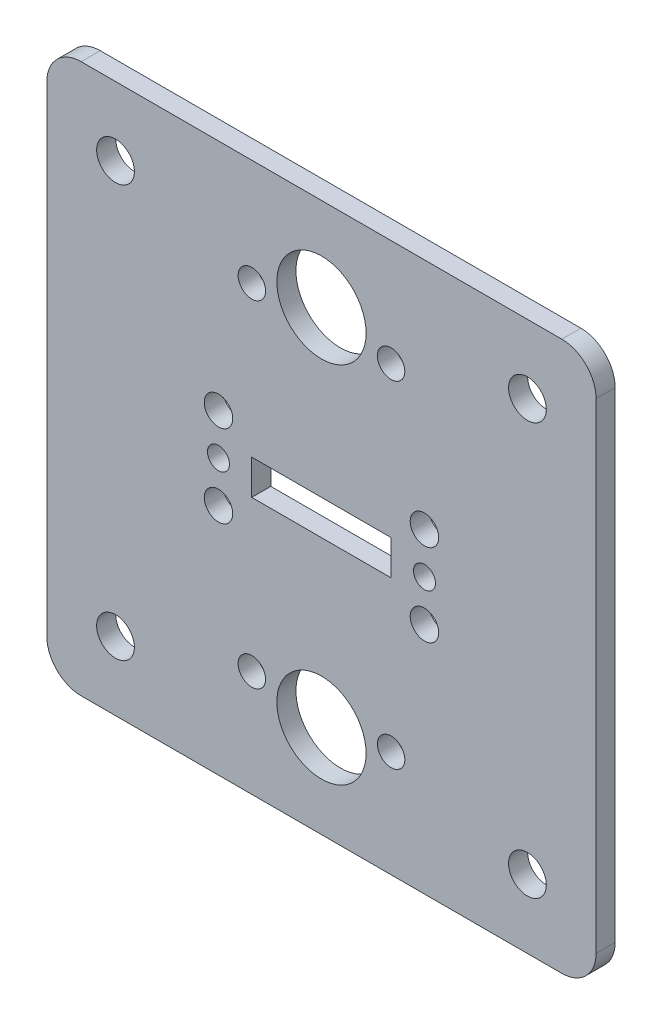
ISO-10303-21;
HEADER;
FILE_DESCRIPTION(('STEP AP214'),'2;1');
FILE_NAME('part.step','',(''),(''),'','','');
FILE_SCHEMA(('AUTOMOTIVE_DESIGN { 1 0 10303 214 1 1 1 1 }'));
ENDSEC;
DATA;
#1=APPLICATION_CONTEXT('core data for automotive mechanical design processes');
#2=APPLICATION_PROTOCOL_DEFINITION('international standard','automotive_design',2000,#1);
#3=PRODUCT_CONTEXT('',#1,'mechanical');
#4=PRODUCT('Part','Part','',(#3));
#5=PRODUCT_RELATED_PRODUCT_CATEGORY('part','',(#4));
#6=PRODUCT_DEFINITION_FORMATION('','',#4);
#7=PRODUCT_DEFINITION_CONTEXT('part definition',#1,'design');
#8=PRODUCT_DEFINITION('design','',#6,#7);
#9=PRODUCT_DEFINITION_SHAPE('','',#8);
#10=(LENGTH_UNIT() NAMED_UNIT(*) SI_UNIT(.MILLI.,.METRE.));
#11=(NAMED_UNIT(*) PLANE_ANGLE_UNIT() SI_UNIT($,.RADIAN.));
#12=(NAMED_UNIT(*) SI_UNIT($,.STERADIAN.) SOLID_ANGLE_UNIT());
#13=UNCERTAINTY_MEASURE_WITH_UNIT(LENGTH_MEASURE(1.E-05),#10,'distance_accuracy_value','');
#14=(GEOMETRIC_REPRESENTATION_CONTEXT(3) GLOBAL_UNCERTAINTY_ASSIGNED_CONTEXT((#13)) GLOBAL_UNIT_ASSIGNED_CONTEXT((#10,
#11,#12)) REPRESENTATION_CONTEXT('',''));
#15=CARTESIAN_POINT('',(0.,0.,0.));
#16=DIRECTION('',(0.,0.,1.));
#17=DIRECTION('',(1.,0.,0.));
#18=AXIS2_PLACEMENT_3D('',#15,#16,#17);
#19=CARTESIAN_POINT('',(-35.,-35.,2.778125));
#20=DIRECTION('',(0.,0.,1.));
#21=DIRECTION('',(1.,0.,0.));
#22=AXIS2_PLACEMENT_3D('',#19,#20,#21);
#23=PLANE('',#22);
#24=CARTESIAN_POINT('',(15.,-6.,2.778125));
#25=DIRECTION('',(0.,0.,1.));
#26=DIRECTION('',(1.,0.,0.));
#27=AXIS2_PLACEMENT_3D('',#24,#25,#26);
#28=CIRCLE('',#27,2.075);
#29=CARTESIAN_POINT('',(17.075,-6.,2.778125));
#30=VERTEX_POINT('',#29);
#31=EDGE_CURVE('E368',#30,#30,#28,.T.);
#32=ORIENTED_EDGE('',*,*,#31,.F.);
#33=EDGE_LOOP('',(#32));
#34=FACE_BOUND('',#33,.T.);
#35=CARTESIAN_POINT('',(-15.,6.,2.778125));
#36=DIRECTION('',(0.,0.,1.));
#37=DIRECTION('',(1.,0.,0.));
#38=AXIS2_PLACEMENT_3D('',#35,#36,#37);
#39=CIRCLE('',#38,2.075);
#40=CARTESIAN_POINT('',(-12.925,6.,2.778125));
#41=VERTEX_POINT('',#40);
#42=EDGE_CURVE('E380',#41,#41,#39,.T.);
#43=ORIENTED_EDGE('',*,*,#42,.F.);
#44=EDGE_LOOP('',(#43));
#45=FACE_BOUND('',#44,.T.);
#46=CARTESIAN_POINT('',(-14.9999999999864,3.40474063403179E-12,2.778125));
#47=DIRECTION('',(0.,0.,1.));
#48=DIRECTION('',(1.,0.,0.));
#49=AXIS2_PLACEMENT_3D('',#46,#47,#48);
#50=CIRCLE('',#49,1.59999999999901);
#51=CARTESIAN_POINT('',(-13.3999999999873,3.40474063403179E-12,2.778125));
#52=VERTEX_POINT('',#51);
#53=EDGE_CURVE('E392',#52,#52,#50,.T.);
#54=ORIENTED_EDGE('',*,*,#53,.F.);
#55=EDGE_LOOP('',(#54));
#56=FACE_BOUND('',#55,.T.);
#57=CARTESIAN_POINT('',(-10.1411109576702,-24.482807611551,2.778125));
#58=DIRECTION('',(0.,0.,1.));
#59=DIRECTION('',(1.,0.,0.));
#60=AXIS2_PLACEMENT_3D('',#57,#58,#59);
#61=CIRCLE('',#60,2.);
#62=CARTESIAN_POINT('',(-8.14111095767023,-24.482807611551,2.778125));
#63=VERTEX_POINT('',#62);
#64=EDGE_CURVE('E404',#63,#63,#61,.T.);
#65=ORIENTED_EDGE('',*,*,#64,.F.);
#66=EDGE_LOOP('',(#65));
#67=FACE_BOUND('',#66,.T.);
#68=CARTESIAN_POINT('',(-10.1411109576752,24.4828076115472,2.778125));
#69=DIRECTION('',(0.,0.,1.));
#70=DIRECTION('',(1.,0.,0.));
#71=AXIS2_PLACEMENT_3D('',#68,#69,#70);
#72=CIRCLE('',#71,2.);
#73=CARTESIAN_POINT('',(-8.14111095767523,24.4828076115472,2.778125));
#74=VERTEX_POINT('',#73);
#75=EDGE_CURVE('E416',#74,#74,#72,.T.);
#76=ORIENTED_EDGE('',*,*,#75,.F.);
#77=EDGE_LOOP('',(#76));
#78=FACE_BOUND('',#77,.T.);
#79=CARTESIAN_POINT('',(2.43730012379827E-12,-26.5,2.778125));
#80=DIRECTION('',(0.,0.,1.));
#81=DIRECTION('',(1.,0.,0.));
#82=AXIS2_PLACEMENT_3D('',#79,#80,#81);
#83=CIRCLE('',#82,6.5);
#84=CARTESIAN_POINT('',(6.50000000000244,-26.5,2.778125));
#85=VERTEX_POINT('',#84);
#86=EDGE_CURVE('E428',#85,#85,#83,.T.);
#87=ORIENTED_EDGE('',*,*,#86,.F.);
#88=EDGE_LOOP('',(#87));
#89=FACE_BOUND('',#88,.T.);
#90=CARTESIAN_POINT('',(30.,-30.,2.778125));
#91=DIRECTION('',(0.,0.,1.));
#92=DIRECTION('',(1.,0.,0.));
#93=AXIS2_PLACEMENT_3D('',#90,#91,#92);
#94=CIRCLE('',#93,2.74999999999999);
#95=CARTESIAN_POINT('',(32.75,-30.,2.778125));
#96=VERTEX_POINT('',#95);
#97=EDGE_CURVE('E440',#96,#96,#94,.T.);
#98=ORIENTED_EDGE('',*,*,#97,.F.);
#99=EDGE_LOOP('',(#98));
#100=FACE_BOUND('',#99,.T.);
#101=CARTESIAN_POINT('',(-30.,30.,2.778125));
#102=DIRECTION('',(0.,0.,1.));
#103=DIRECTION('',(1.,0.,0.));
#104=AXIS2_PLACEMENT_3D('',#101,#102,#103);
#105=CIRCLE('',#104,2.75);
#106=CARTESIAN_POINT('',(-27.25,30.,2.778125));
#107=VERTEX_POINT('',#106);
#108=EDGE_CURVE('E151',#107,#107,#105,.T.);
#109=ORIENTED_EDGE('',*,*,#108,.F.);
#110=EDGE_LOOP('',(#109));
#111=FACE_BOUND('',#110,.T.);
#112=CARTESIAN_POINT('',(-35.,-35.,2.778125));
#113=DIRECTION('',(0.,0.,1.));
#114=DIRECTION('',(1.,0.,0.));
#115=AXIS2_PLACEMENT_3D('',#112,#113,#114);
#116=CIRCLE('',#115,4.99999999999999);
#117=CARTESIAN_POINT('',(-40.,-35.,2.778125));
#118=VERTEX_POINT('',#117);
#119=CARTESIAN_POINT('',(-35.,-40.,2.778125));
#120=VERTEX_POINT('',#119);
#121=EDGE_CURVE('E161',#118,#120,#116,.T.);
#122=ORIENTED_EDGE('',*,*,#121,.T.);
#123=DIRECTION('',(1.,0.,0.));
#124=VECTOR('',#123,1.);
#125=CARTESIAN_POINT('',(35.,-40.,2.778125));
#126=LINE('',#125,#124);
#127=CARTESIAN_POINT('',(35.,-40.,2.778125));
#128=VERTEX_POINT('',#127);
#129=EDGE_CURVE('E164',#120,#128,#126,.T.);
#130=ORIENTED_EDGE('',*,*,#129,.T.);
#131=CARTESIAN_POINT('',(35.,-35.,2.778125));
#132=DIRECTION('',(0.,0.,1.));
#133=DIRECTION('',(1.,0.,0.));
#134=AXIS2_PLACEMENT_3D('',#131,#132,#133);
#135=CIRCLE('',#134,5.);
#136=CARTESIAN_POINT('',(40.,-35.,2.778125));
#137=VERTEX_POINT('',#136);
#138=EDGE_CURVE('E167',#128,#137,#135,.T.);
#139=ORIENTED_EDGE('',*,*,#138,.T.);
#140=DIRECTION('',(0.,1.,0.));
#141=VECTOR('',#140,1.);
#142=CARTESIAN_POINT('',(40.,-35.,2.778125));
#143=LINE('',#142,#141);
#144=CARTESIAN_POINT('',(40.,35.,2.778125));
#145=VERTEX_POINT('',#144);
#146=EDGE_CURVE('E169',#137,#145,#143,.T.);
#147=ORIENTED_EDGE('',*,*,#146,.T.);
#148=CARTESIAN_POINT('',(35.,35.,2.778125));
#149=DIRECTION('',(0.,0.,1.));
#150=DIRECTION('',(1.,0.,0.));
#151=AXIS2_PLACEMENT_3D('',#148,#149,#150);
#152=CIRCLE('',#151,5.);
#153=CARTESIAN_POINT('',(35.,40.,2.778125));
#154=VERTEX_POINT('',#153);
#155=EDGE_CURVE('E171',#145,#154,#152,.T.);
#156=ORIENTED_EDGE('',*,*,#155,.T.);
#157=DIRECTION('',(-1.,0.,0.));
#158=VECTOR('',#157,1.);
#159=CARTESIAN_POINT('',(35.,40.,2.778125));
#160=LINE('',#159,#158);
#161=CARTESIAN_POINT('',(-35.,40.,2.778125));
#162=VERTEX_POINT('',#161);
#163=EDGE_CURVE('E173',#154,#162,#160,.T.);
#164=ORIENTED_EDGE('',*,*,#163,.T.);
#165=CARTESIAN_POINT('',(-35.,35.,2.778125));
#166=DIRECTION('',(0.,0.,1.));
#167=DIRECTION('',(1.,0.,0.));
#168=AXIS2_PLACEMENT_3D('',#165,#166,#167);
#169=CIRCLE('',#168,5.);
#170=CARTESIAN_POINT('',(-40.,35.,2.778125));
#171=VERTEX_POINT('',#170);
#172=EDGE_CURVE('E175',#162,#171,#169,.T.);
#173=ORIENTED_EDGE('',*,*,#172,.T.);
#174=DIRECTION('',(0.,-1.,0.));
#175=VECTOR('',#174,1.);
#176=CARTESIAN_POINT('',(-40.,-35.,2.778125));
#177=LINE('',#176,#175);
#178=EDGE_CURVE('E177',#171,#118,#177,.T.);
#179=ORIENTED_EDGE('',*,*,#178,.T.);
#180=EDGE_LOOP('',(#122,#130,#139,#147,#156,#164,#173,#179));
#181=FACE_BOUND('',#180,.T.);
#182=DIRECTION('',(-1.,0.,0.));
#183=VECTOR('',#182,1.);
#184=CARTESIAN_POINT('',(10.16,2.53999999999999,2.778125));
#185=LINE('',#184,#183);
#186=CARTESIAN_POINT('',(10.16,2.53999999999999,2.778125));
#187=VERTEX_POINT('',#186);
#188=CARTESIAN_POINT('',(-10.16,2.54,2.778125));
#189=VERTEX_POINT('',#188);
#190=EDGE_CURVE('E130',#187,#189,#185,.T.);
#191=ORIENTED_EDGE('',*,*,#190,.F.);
#192=DIRECTION('',(0.,1.,0.));
#193=VECTOR('',#192,1.);
#194=CARTESIAN_POINT('',(10.16,-2.54,2.778125));
#195=LINE('',#194,#193);
#196=CARTESIAN_POINT('',(10.16,-2.54,2.778125));
#197=VERTEX_POINT('',#196);
#198=EDGE_CURVE('E122',#197,#187,#195,.T.);
#199=ORIENTED_EDGE('',*,*,#198,.F.);
#200=DIRECTION('',(1.,0.,0.));
#201=VECTOR('',#200,1.);
#202=CARTESIAN_POINT('',(10.16,-2.54,2.778125));
#203=LINE('',#202,#201);
#204=CARTESIAN_POINT('',(-10.16,-2.54,2.778125));
#205=VERTEX_POINT('',#204);
#206=EDGE_CURVE('E145',#205,#197,#203,.T.);
#207=ORIENTED_EDGE('',*,*,#206,.F.);
#208=DIRECTION('',(0.,-1.,0.));
#209=VECTOR('',#208,1.);
#210=CARTESIAN_POINT('',(-10.16,-2.54,2.778125));
#211=LINE('',#210,#209);
#212=EDGE_CURVE('E143',#189,#205,#211,.T.);
#213=ORIENTED_EDGE('',*,*,#212,.F.);
#214=EDGE_LOOP('',(#191,#199,#207,#213));
#215=FACE_BOUND('',#214,.T.);
#216=CARTESIAN_POINT('',(30.,30.,2.778125));
#217=DIRECTION('',(0.,0.,1.));
#218=DIRECTION('',(1.,0.,0.));
#219=AXIS2_PLACEMENT_3D('',#216,#217,#218);
#220=CIRCLE('',#219,2.75);
#221=CARTESIAN_POINT('',(32.75,30.,2.778125));
#222=VERTEX_POINT('',#221);
#223=EDGE_CURVE('E446',#222,#222,#220,.T.);
#224=ORIENTED_EDGE('',*,*,#223,.F.);
#225=EDGE_LOOP('',(#224));
#226=FACE_BOUND('',#225,.T.);
#227=CARTESIAN_POINT('',(-30.,-30.,2.778125));
#228=DIRECTION('',(0.,0.,1.));
#229=DIRECTION('',(1.,0.,0.));
#230=AXIS2_PLACEMENT_3D('',#227,#228,#229);
#231=CIRCLE('',#230,2.74999999999999);
#232=CARTESIAN_POINT('',(-27.25,-30.,2.778125));
#233=VERTEX_POINT('',#232);
#234=EDGE_CURVE('E434',#233,#233,#231,.T.);
#235=ORIENTED_EDGE('',*,*,#234,.F.);
#236=EDGE_LOOP('',(#235));
#237=FACE_BOUND('',#236,.T.);
#238=CARTESIAN_POINT('',(0.,26.5,2.778125));
#239=DIRECTION('',(0.,0.,1.));
#240=DIRECTION('',(1.,0.,0.));
#241=AXIS2_PLACEMENT_3D('',#238,#239,#240);
#242=CIRCLE('',#241,6.5);
#243=CARTESIAN_POINT('',(6.5,26.5,2.778125));
#244=VERTEX_POINT('',#243);
#245=EDGE_CURVE('E422',#244,#244,#242,.T.);
#246=ORIENTED_EDGE('',*,*,#245,.F.);
#247=EDGE_LOOP('',(#246));
#248=FACE_BOUND('',#247,.T.);
#249=CARTESIAN_POINT('',(10.1411109576745,24.4828076115492,2.778125));
#250=DIRECTION('',(0.,0.,1.));
#251=DIRECTION('',(1.,0.,0.));
#252=AXIS2_PLACEMENT_3D('',#249,#250,#251);
#253=CIRCLE('',#252,2.);
#254=CARTESIAN_POINT('',(12.1411109576745,24.4828076115492,2.778125));
#255=VERTEX_POINT('',#254);
#256=EDGE_CURVE('E410',#255,#255,#253,.T.);
#257=ORIENTED_EDGE('',*,*,#256,.F.);
#258=EDGE_LOOP('',(#257));
#259=FACE_BOUND('',#258,.T.);
#260=CARTESIAN_POINT('',(10.1411109576795,-24.482807611549,2.778125));
#261=DIRECTION('',(0.,0.,1.));
#262=DIRECTION('',(1.,0.,0.));
#263=AXIS2_PLACEMENT_3D('',#260,#261,#262);
#264=CIRCLE('',#263,2.);
#265=CARTESIAN_POINT('',(12.1411109576795,-24.482807611549,2.778125));
#266=VERTEX_POINT('',#265);
#267=EDGE_CURVE('E398',#266,#266,#264,.T.);
#268=ORIENTED_EDGE('',*,*,#267,.F.);
#269=EDGE_LOOP('',(#268));
#270=FACE_BOUND('',#269,.T.);
#271=CARTESIAN_POINT('',(14.9999999999864,3.40841457442923E-12,2.778125));
#272=DIRECTION('',(0.,0.,1.));
#273=DIRECTION('',(1.,0.,0.));
#274=AXIS2_PLACEMENT_3D('',#271,#272,#273);
#275=CIRCLE('',#274,1.599999999999);
#276=CARTESIAN_POINT('',(16.5999999999854,3.40841457442923E-12,2.778125));
#277=VERTEX_POINT('',#276);
#278=EDGE_CURVE('E386',#277,#277,#275,.T.);
#279=ORIENTED_EDGE('',*,*,#278,.F.);
#280=EDGE_LOOP('',(#279));
#281=FACE_BOUND('',#280,.T.);
#282=CARTESIAN_POINT('',(15.,6.,2.778125));
#283=DIRECTION('',(0.,0.,1.));
#284=DIRECTION('',(-1.,0.,0.));
#285=AXIS2_PLACEMENT_3D('',#282,#283,#284);
#286=CIRCLE('',#285,2.075);
#287=CARTESIAN_POINT('',(12.925,6.,2.778125));
#288=VERTEX_POINT('',#287);
#289=EDGE_CURVE('E374',#288,#288,#286,.T.);
#290=ORIENTED_EDGE('',*,*,#289,.F.);
#291=EDGE_LOOP('',(#290));
#292=FACE_BOUND('',#291,.T.);
#293=CARTESIAN_POINT('',(-15.,-6.,2.778125));
#294=DIRECTION('',(0.,0.,1.));
#295=DIRECTION('',(-1.,0.,0.));
#296=AXIS2_PLACEMENT_3D('',#293,#294,#295);
#297=CIRCLE('',#296,2.075);
#298=CARTESIAN_POINT('',(-17.075,-6.,2.778125));
#299=VERTEX_POINT('',#298);
#300=EDGE_CURVE('E359',#299,#299,#297,.T.);
#301=ORIENTED_EDGE('',*,*,#300,.F.);
#302=EDGE_LOOP('',(#301));
#303=FACE_BOUND('',#302,.T.);
#304=ADVANCED_FACE('F33',(#34,#45,#56,#67,#78,#89,#100,#111,#181,#215,#226,#237,#248,#259,#270,
#281,#292,#303),#23,.T.);
#305=CARTESIAN_POINT('',(-35.,-35.,0.));
#306=DIRECTION('',(0.,0.,1.));
#307=DIRECTION('',(1.,0.,0.));
#308=AXIS2_PLACEMENT_3D('',#305,#306,#307);
#309=PLANE('',#308);
#310=CARTESIAN_POINT('',(15.,-6.,0.));
#311=DIRECTION('',(0.,0.,1.));
#312=DIRECTION('',(1.,0.,0.));
#313=AXIS2_PLACEMENT_3D('',#310,#311,#312);
#314=CIRCLE('',#313,2.075);
#315=CARTESIAN_POINT('',(17.075,-6.,0.));
#316=VERTEX_POINT('',#315);
#317=EDGE_CURVE('E365',#316,#316,#314,.T.);
#318=ORIENTED_EDGE('',*,*,#317,.T.);
#319=EDGE_LOOP('',(#318));
#320=FACE_BOUND('',#319,.T.);
#321=CARTESIAN_POINT('',(-15.,6.,0.));
#322=DIRECTION('',(0.,0.,1.));
#323=DIRECTION('',(1.,0.,0.));
#324=AXIS2_PLACEMENT_3D('',#321,#322,#323);
#325=CIRCLE('',#324,2.075);
#326=CARTESIAN_POINT('',(-12.925,6.,0.));
#327=VERTEX_POINT('',#326);
#328=EDGE_CURVE('E377',#327,#327,#325,.T.);
#329=ORIENTED_EDGE('',*,*,#328,.T.);
#330=EDGE_LOOP('',(#329));
#331=FACE_BOUND('',#330,.T.);
#332=CARTESIAN_POINT('',(-14.9999999999864,3.40474063403179E-12,0.));
#333=DIRECTION('',(0.,0.,1.));
#334=DIRECTION('',(1.,0.,0.));
#335=AXIS2_PLACEMENT_3D('',#332,#333,#334);
#336=CIRCLE('',#335,1.59999999999901);
#337=CARTESIAN_POINT('',(-13.3999999999873,3.40474063403179E-12,0.));
#338=VERTEX_POINT('',#337);
#339=EDGE_CURVE('E389',#338,#338,#336,.T.);
#340=ORIENTED_EDGE('',*,*,#339,.T.);
#341=EDGE_LOOP('',(#340));
#342=FACE_BOUND('',#341,.T.);
#343=CARTESIAN_POINT('',(-10.1411109576702,-24.482807611551,0.));
#344=DIRECTION('',(0.,0.,1.));
#345=DIRECTION('',(1.,0.,0.));
#346=AXIS2_PLACEMENT_3D('',#343,#344,#345);
#347=CIRCLE('',#346,2.);
#348=CARTESIAN_POINT('',(-8.14111095767023,-24.482807611551,0.));
#349=VERTEX_POINT('',#348);
#350=EDGE_CURVE('E401',#349,#349,#347,.T.);
#351=ORIENTED_EDGE('',*,*,#350,.T.);
#352=EDGE_LOOP('',(#351));
#353=FACE_BOUND('',#352,.T.);
#354=CARTESIAN_POINT('',(-10.1411109576752,24.4828076115472,0.));
#355=DIRECTION('',(0.,0.,1.));
#356=DIRECTION('',(1.,0.,0.));
#357=AXIS2_PLACEMENT_3D('',#354,#355,#356);
#358=CIRCLE('',#357,2.);
#359=CARTESIAN_POINT('',(-8.14111095767523,24.4828076115472,0.));
#360=VERTEX_POINT('',#359);
#361=EDGE_CURVE('E413',#360,#360,#358,.T.);
#362=ORIENTED_EDGE('',*,*,#361,.T.);
#363=EDGE_LOOP('',(#362));
#364=FACE_BOUND('',#363,.T.);
#365=CARTESIAN_POINT('',(2.43730012379827E-12,-26.5,0.));
#366=DIRECTION('',(0.,0.,1.));
#367=DIRECTION('',(1.,0.,0.));
#368=AXIS2_PLACEMENT_3D('',#365,#366,#367);
#369=CIRCLE('',#368,6.5);
#370=CARTESIAN_POINT('',(6.50000000000244,-26.5,0.));
#371=VERTEX_POINT('',#370);
#372=EDGE_CURVE('E425',#371,#371,#369,.T.);
#373=ORIENTED_EDGE('',*,*,#372,.T.);
#374=EDGE_LOOP('',(#373));
#375=FACE_BOUND('',#374,.T.);
#376=CARTESIAN_POINT('',(30.,-30.,0.));
#377=DIRECTION('',(0.,0.,1.));
#378=DIRECTION('',(1.,0.,0.));
#379=AXIS2_PLACEMENT_3D('',#376,#377,#378);
#380=CIRCLE('',#379,2.74999999999999);
#381=CARTESIAN_POINT('',(32.75,-30.,0.));
#382=VERTEX_POINT('',#381);
#383=EDGE_CURVE('E437',#382,#382,#380,.T.);
#384=ORIENTED_EDGE('',*,*,#383,.T.);
#385=EDGE_LOOP('',(#384));
#386=FACE_BOUND('',#385,.T.);
#387=CARTESIAN_POINT('',(-30.,30.,0.));
#388=DIRECTION('',(0.,0.,1.));
#389=DIRECTION('',(1.,0.,0.));
#390=AXIS2_PLACEMENT_3D('',#387,#388,#389);
#391=CIRCLE('',#390,2.75);
#392=CARTESIAN_POINT('',(-27.25,30.,0.));
#393=VERTEX_POINT('',#392);
#394=EDGE_CURVE('E449',#393,#393,#391,.T.);
#395=ORIENTED_EDGE('',*,*,#394,.T.);
#396=EDGE_LOOP('',(#395));
#397=FACE_BOUND('',#396,.T.);
#398=CARTESIAN_POINT('',(-35.,-35.,0.));
#399=DIRECTION('',(0.,0.,1.));
#400=DIRECTION('',(1.,0.,0.));
#401=AXIS2_PLACEMENT_3D('',#398,#399,#400);
#402=CIRCLE('',#401,4.99999999999999);
#403=CARTESIAN_POINT('',(-40.,-35.,0.));
#404=VERTEX_POINT('',#403);
#405=CARTESIAN_POINT('',(-35.,-40.,0.));
#406=VERTEX_POINT('',#405);
#407=EDGE_CURVE('E138',#404,#406,#402,.T.);
#408=ORIENTED_EDGE('',*,*,#407,.F.);
#409=DIRECTION('',(0.,-1.,0.));
#410=VECTOR('',#409,1.);
#411=CARTESIAN_POINT('',(-40.,-35.,0.));
#412=LINE('',#411,#410);
#413=CARTESIAN_POINT('',(-40.,35.,0.));
#414=VERTEX_POINT('',#413);
#415=EDGE_CURVE('E165',#414,#404,#412,.T.);
#416=ORIENTED_EDGE('',*,*,#415,.F.);
#417=CARTESIAN_POINT('',(-35.,35.,0.));
#418=DIRECTION('',(0.,0.,1.));
#419=DIRECTION('',(1.,0.,0.));
#420=AXIS2_PLACEMENT_3D('',#417,#418,#419);
#421=CIRCLE('',#420,5.);
#422=CARTESIAN_POINT('',(-35.,40.,0.));
#423=VERTEX_POINT('',#422);
#424=EDGE_CURVE('E192',#423,#414,#421,.T.);
#425=ORIENTED_EDGE('',*,*,#424,.F.);
#426=DIRECTION('',(-1.,0.,0.));
#427=VECTOR('',#426,1.);
#428=CARTESIAN_POINT('',(35.,40.,0.));
#429=LINE('',#428,#427);
#430=CARTESIAN_POINT('',(35.,40.,0.));
#431=VERTEX_POINT('',#430);
#432=EDGE_CURVE('E190',#431,#423,#429,.T.);
#433=ORIENTED_EDGE('',*,*,#432,.F.);
#434=CARTESIAN_POINT('',(35.,35.,0.));
#435=DIRECTION('',(0.,0.,1.));
#436=DIRECTION('',(1.,0.,0.));
#437=AXIS2_PLACEMENT_3D('',#434,#435,#436);
#438=CIRCLE('',#437,5.);
#439=CARTESIAN_POINT('',(40.,35.,0.));
#440=VERTEX_POINT('',#439);
#441=EDGE_CURVE('E188',#440,#431,#438,.T.);
#442=ORIENTED_EDGE('',*,*,#441,.F.);
#443=DIRECTION('',(0.,1.,0.));
#444=VECTOR('',#443,1.);
#445=CARTESIAN_POINT('',(40.,-35.,0.));
#446=LINE('',#445,#444);
#447=CARTESIAN_POINT('',(40.,-35.,0.));
#448=VERTEX_POINT('',#447);
#449=EDGE_CURVE('E186',#448,#440,#446,.T.);
#450=ORIENTED_EDGE('',*,*,#449,.F.);
#451=CARTESIAN_POINT('',(35.,-35.,0.));
#452=DIRECTION('',(0.,0.,1.));
#453=DIRECTION('',(1.,0.,0.));
#454=AXIS2_PLACEMENT_3D('',#451,#452,#453);
#455=CIRCLE('',#454,5.);
#456=CARTESIAN_POINT('',(35.,-40.,0.));
#457=VERTEX_POINT('',#456);
#458=EDGE_CURVE('E184',#457,#448,#455,.T.);
#459=ORIENTED_EDGE('',*,*,#458,.F.);
#460=DIRECTION('',(1.,0.,0.));
#461=VECTOR('',#460,1.);
#462=CARTESIAN_POINT('',(35.,-40.,0.));
#463=LINE('',#462,#461);
#464=EDGE_CURVE('E182',#406,#457,#463,.T.);
#465=ORIENTED_EDGE('',*,*,#464,.F.);
#466=EDGE_LOOP('',(#408,#416,#425,#433,#442,#450,#459,#465));
#467=FACE_BOUND('',#466,.T.);
#468=DIRECTION('',(0.,1.,0.));
#469=VECTOR('',#468,1.);
#470=CARTESIAN_POINT('',(10.16,-2.54,0.));
#471=LINE('',#470,#469);
#472=CARTESIAN_POINT('',(10.16,-2.54,0.));
#473=VERTEX_POINT('',#472);
#474=CARTESIAN_POINT('',(10.16,2.53999999999999,0.));
#475=VERTEX_POINT('',#474);
#476=EDGE_CURVE('E56',#473,#475,#471,.T.);
#477=ORIENTED_EDGE('',*,*,#476,.T.);
#478=DIRECTION('',(-1.,0.,0.));
#479=VECTOR('',#478,1.);
#480=CARTESIAN_POINT('',(10.16,2.53999999999999,0.));
#481=LINE('',#480,#479);
#482=CARTESIAN_POINT('',(-10.16,2.54,0.));
#483=VERTEX_POINT('',#482);
#484=EDGE_CURVE('E137',#475,#483,#481,.T.);
#485=ORIENTED_EDGE('',*,*,#484,.T.);
#486=DIRECTION('',(0.,-1.,0.));
#487=VECTOR('',#486,1.);
#488=CARTESIAN_POINT('',(-10.16,-2.54,0.));
#489=LINE('',#488,#487);
#490=CARTESIAN_POINT('',(-10.16,-2.54,0.));
#491=VERTEX_POINT('',#490);
#492=EDGE_CURVE('E153',#483,#491,#489,.T.);
#493=ORIENTED_EDGE('',*,*,#492,.T.);
#494=DIRECTION('',(1.,0.,0.));
#495=VECTOR('',#494,1.);
#496=CARTESIAN_POINT('',(10.16,-2.54,0.));
#497=LINE('',#496,#495);
#498=EDGE_CURVE('E131',#491,#473,#497,.T.);
#499=ORIENTED_EDGE('',*,*,#498,.T.);
#500=EDGE_LOOP('',(#477,#485,#493,#499));
#501=FACE_BOUND('',#500,.T.);
#502=CARTESIAN_POINT('',(30.,30.,0.));
#503=DIRECTION('',(0.,0.,1.));
#504=DIRECTION('',(1.,0.,0.));
#505=AXIS2_PLACEMENT_3D('',#502,#503,#504);
#506=CIRCLE('',#505,2.75);
#507=CARTESIAN_POINT('',(32.75,30.,0.));
#508=VERTEX_POINT('',#507);
#509=EDGE_CURVE('E443',#508,#508,#506,.T.);
#510=ORIENTED_EDGE('',*,*,#509,.T.);
#511=EDGE_LOOP('',(#510));
#512=FACE_BOUND('',#511,.T.);
#513=CARTESIAN_POINT('',(-30.,-30.,0.));
#514=DIRECTION('',(0.,0.,1.));
#515=DIRECTION('',(1.,0.,0.));
#516=AXIS2_PLACEMENT_3D('',#513,#514,#515);
#517=CIRCLE('',#516,2.74999999999999);
#518=CARTESIAN_POINT('',(-27.25,-30.,0.));
#519=VERTEX_POINT('',#518);
#520=EDGE_CURVE('E431',#519,#519,#517,.T.);
#521=ORIENTED_EDGE('',*,*,#520,.T.);
#522=EDGE_LOOP('',(#521));
#523=FACE_BOUND('',#522,.T.);
#524=CARTESIAN_POINT('',(0.,26.5,0.));
#525=DIRECTION('',(0.,0.,1.));
#526=DIRECTION('',(1.,0.,0.));
#527=AXIS2_PLACEMENT_3D('',#524,#525,#526);
#528=CIRCLE('',#527,6.5);
#529=CARTESIAN_POINT('',(6.5,26.5,0.));
#530=VERTEX_POINT('',#529);
#531=EDGE_CURVE('E419',#530,#530,#528,.T.);
#532=ORIENTED_EDGE('',*,*,#531,.T.);
#533=EDGE_LOOP('',(#532));
#534=FACE_BOUND('',#533,.T.);
#535=CARTESIAN_POINT('',(10.1411109576745,24.4828076115492,0.));
#536=DIRECTION('',(0.,0.,1.));
#537=DIRECTION('',(1.,0.,0.));
#538=AXIS2_PLACEMENT_3D('',#535,#536,#537);
#539=CIRCLE('',#538,2.);
#540=CARTESIAN_POINT('',(12.1411109576745,24.4828076115492,0.));
#541=VERTEX_POINT('',#540);
#542=EDGE_CURVE('E407',#541,#541,#539,.T.);
#543=ORIENTED_EDGE('',*,*,#542,.T.);
#544=EDGE_LOOP('',(#543));
#545=FACE_BOUND('',#544,.T.);
#546=CARTESIAN_POINT('',(10.1411109576795,-24.482807611549,0.));
#547=DIRECTION('',(0.,0.,1.));
#548=DIRECTION('',(1.,0.,0.));
#549=AXIS2_PLACEMENT_3D('',#546,#547,#548);
#550=CIRCLE('',#549,2.);
#551=CARTESIAN_POINT('',(12.1411109576795,-24.482807611549,0.));
#552=VERTEX_POINT('',#551);
#553=EDGE_CURVE('E395',#552,#552,#550,.T.);
#554=ORIENTED_EDGE('',*,*,#553,.T.);
#555=EDGE_LOOP('',(#554));
#556=FACE_BOUND('',#555,.T.);
#557=CARTESIAN_POINT('',(14.9999999999864,3.40841457442923E-12,0.));
#558=DIRECTION('',(0.,0.,1.));
#559=DIRECTION('',(1.,0.,0.));
#560=AXIS2_PLACEMENT_3D('',#557,#558,#559);
#561=CIRCLE('',#560,1.599999999999);
#562=CARTESIAN_POINT('',(16.5999999999854,3.40841457442923E-12,0.));
#563=VERTEX_POINT('',#562);
#564=EDGE_CURVE('E383',#563,#563,#561,.T.);
#565=ORIENTED_EDGE('',*,*,#564,.T.);
#566=EDGE_LOOP('',(#565));
#567=FACE_BOUND('',#566,.T.);
#568=CARTESIAN_POINT('',(15.,6.,0.));
#569=DIRECTION('',(0.,0.,1.));
#570=DIRECTION('',(-1.,0.,0.));
#571=AXIS2_PLACEMENT_3D('',#568,#569,#570);
#572=CIRCLE('',#571,2.075);
#573=CARTESIAN_POINT('',(12.925,6.,0.));
#574=VERTEX_POINT('',#573);
#575=EDGE_CURVE('E371',#574,#574,#572,.T.);
#576=ORIENTED_EDGE('',*,*,#575,.T.);
#577=EDGE_LOOP('',(#576));
#578=FACE_BOUND('',#577,.T.);
#579=CARTESIAN_POINT('',(-15.,-6.,0.));
#580=DIRECTION('',(0.,0.,1.));
#581=DIRECTION('',(-1.,0.,0.));
#582=AXIS2_PLACEMENT_3D('',#579,#580,#581);
#583=CIRCLE('',#582,2.075);
#584=CARTESIAN_POINT('',(-17.075,-6.,0.));
#585=VERTEX_POINT('',#584);
#586=EDGE_CURVE('E362',#585,#585,#583,.T.);
#587=ORIENTED_EDGE('',*,*,#586,.T.);
#588=EDGE_LOOP('',(#587));
#589=FACE_BOUND('',#588,.T.);
#590=ADVANCED_FACE('F222',(#320,#331,#342,#353,#364,#375,#386,#397,#467,#501,#512,#523,#534,
#545,#556,#567,#578,#589),#309,.F.);
#591=CARTESIAN_POINT('',(-35.,-35.,2.778125));
#592=DIRECTION('',(0.,0.,-1.));
#593=DIRECTION('',(-1.,0.,0.));
#594=AXIS2_PLACEMENT_3D('',#591,#592,#593);
#595=CYLINDRICAL_SURFACE('',#594,4.99999999999999);
#596=ORIENTED_EDGE('',*,*,#407,.T.);
#597=DIRECTION('',(0.,0.,-1.));
#598=VECTOR('',#597,1.);
#599=CARTESIAN_POINT('',(-35.,-40.,2.778125));
#600=LINE('',#599,#598);
#601=EDGE_CURVE('E11',#120,#406,#600,.T.);
#602=ORIENTED_EDGE('',*,*,#601,.F.);
#603=ORIENTED_EDGE('',*,*,#121,.F.);
#604=DIRECTION('',(0.,0.,-1.));
#605=VECTOR('',#604,1.);
#606=CARTESIAN_POINT('',(-40.,-35.,2.778125));
#607=LINE('',#606,#605);
#608=EDGE_CURVE('E179',#118,#404,#607,.T.);
#609=ORIENTED_EDGE('',*,*,#608,.T.);
#610=EDGE_LOOP('',(#596,#602,#603,#609));
#611=FACE_BOUND('',#610,.T.);
#612=ADVANCED_FACE('F35',(#611),#595,.T.);
#613=CARTESIAN_POINT('',(35.,-40.,2.778125));
#614=DIRECTION('',(0.,1.,0.));
#615=DIRECTION('',(0.,0.,1.));
#616=AXIS2_PLACEMENT_3D('',#613,#614,#615);
#617=PLANE('',#616);
#618=ORIENTED_EDGE('',*,*,#464,.T.);
#619=DIRECTION('',(0.,0.,-1.));
#620=VECTOR('',#619,1.);
#621=CARTESIAN_POINT('',(35.,-40.,2.778125));
#622=LINE('',#621,#620);
#623=EDGE_CURVE('E41',#128,#457,#622,.T.);
#624=ORIENTED_EDGE('',*,*,#623,.F.);
#625=ORIENTED_EDGE('',*,*,#129,.F.);
#626=ORIENTED_EDGE('',*,*,#601,.T.);
#627=EDGE_LOOP('',(#618,#624,#625,#626));
#628=FACE_BOUND('',#627,.T.);
#629=ADVANCED_FACE('F239',(#628),#617,.F.);
#630=CARTESIAN_POINT('',(35.,-35.,2.778125));
#631=DIRECTION('',(0.,0.,-1.));
#632=DIRECTION('',(-1.,0.,0.));
#633=AXIS2_PLACEMENT_3D('',#630,#631,#632);
#634=CYLINDRICAL_SURFACE('',#633,5.);
#635=ORIENTED_EDGE('',*,*,#458,.T.);
#636=DIRECTION('',(0.,0.,-1.));
#637=VECTOR('',#636,1.);
#638=CARTESIAN_POINT('',(40.,-35.,2.778125));
#639=LINE('',#638,#637);
#640=EDGE_CURVE('E209',#137,#448,#639,.T.);
#641=ORIENTED_EDGE('',*,*,#640,.F.);
#642=ORIENTED_EDGE('',*,*,#138,.F.);
#643=ORIENTED_EDGE('',*,*,#623,.T.);
#644=EDGE_LOOP('',(#635,#641,#642,#643));
#645=FACE_BOUND('',#644,.T.);
#646=ADVANCED_FACE('F216',(#645),#634,.T.);
#647=CARTESIAN_POINT('',(40.,-35.,2.778125));
#648=DIRECTION('',(-1.,0.,0.));
#649=DIRECTION('',(0.,0.,1.));
#650=AXIS2_PLACEMENT_3D('',#647,#648,#649);
#651=PLANE('',#650);
#652=ORIENTED_EDGE('',*,*,#449,.T.);
#653=DIRECTION('',(0.,0.,-1.));
#654=VECTOR('',#653,1.);
#655=CARTESIAN_POINT('',(40.,35.,2.778125));
#656=LINE('',#655,#654);
#657=EDGE_CURVE('E206',#145,#440,#656,.T.);
#658=ORIENTED_EDGE('',*,*,#657,.F.);
#659=ORIENTED_EDGE('',*,*,#146,.F.);
#660=ORIENTED_EDGE('',*,*,#640,.T.);
#661=EDGE_LOOP('',(#652,#658,#659,#660));
#662=FACE_BOUND('',#661,.T.);
#663=ADVANCED_FACE('F228',(#662),#651,.F.);
#664=CARTESIAN_POINT('',(35.,35.,2.778125));
#665=DIRECTION('',(0.,0.,-1.));
#666=DIRECTION('',(-1.,0.,0.));
#667=AXIS2_PLACEMENT_3D('',#664,#665,#666);
#668=CYLINDRICAL_SURFACE('',#667,5.);
#669=ORIENTED_EDGE('',*,*,#441,.T.);
#670=DIRECTION('',(0.,0.,-1.));
#671=VECTOR('',#670,1.);
#672=CARTESIAN_POINT('',(35.,40.,2.778125));
#673=LINE('',#672,#671);
#674=EDGE_CURVE('E203',#154,#431,#673,.T.);
#675=ORIENTED_EDGE('',*,*,#674,.F.);
#676=ORIENTED_EDGE('',*,*,#155,.F.);
#677=ORIENTED_EDGE('',*,*,#657,.T.);
#678=EDGE_LOOP('',(#669,#675,#676,#677));
#679=FACE_BOUND('',#678,.T.);
#680=ADVANCED_FACE('F232',(#679),#668,.T.);
#681=CARTESIAN_POINT('',(35.,40.,2.778125));
#682=DIRECTION('',(0.,-1.,0.));
#683=DIRECTION('',(1.,0.,0.));
#684=AXIS2_PLACEMENT_3D('',#681,#682,#683);
#685=PLANE('',#684);
#686=ORIENTED_EDGE('',*,*,#432,.T.);
#687=DIRECTION('',(0.,0.,-1.));
#688=VECTOR('',#687,1.);
#689=CARTESIAN_POINT('',(-35.,40.,2.778125));
#690=LINE('',#689,#688);
#691=EDGE_CURVE('E200',#162,#423,#690,.T.);
#692=ORIENTED_EDGE('',*,*,#691,.F.);
#693=ORIENTED_EDGE('',*,*,#163,.F.);
#694=ORIENTED_EDGE('',*,*,#674,.T.);
#695=EDGE_LOOP('',(#686,#692,#693,#694));
#696=FACE_BOUND('',#695,.T.);
#697=ADVANCED_FACE('F252',(#696),#685,.F.);
#698=CARTESIAN_POINT('',(-35.,35.,2.778125));
#699=DIRECTION('',(0.,0.,-1.));
#700=DIRECTION('',(-1.,0.,0.));
#701=AXIS2_PLACEMENT_3D('',#698,#699,#700);
#702=CYLINDRICAL_SURFACE('',#701,5.);
#703=ORIENTED_EDGE('',*,*,#424,.T.);
#704=DIRECTION('',(0.,0.,-1.));
#705=VECTOR('',#704,1.);
#706=CARTESIAN_POINT('',(-40.,35.,2.778125));
#707=LINE('',#706,#705);
#708=EDGE_CURVE('E197',#171,#414,#707,.T.);
#709=ORIENTED_EDGE('',*,*,#708,.F.);
#710=ORIENTED_EDGE('',*,*,#172,.F.);
#711=ORIENTED_EDGE('',*,*,#691,.T.);
#712=EDGE_LOOP('',(#703,#709,#710,#711));
#713=FACE_BOUND('',#712,.T.);
#714=ADVANCED_FACE('F250',(#713),#702,.T.);
#715=CARTESIAN_POINT('',(-40.,-35.,2.778125));
#716=DIRECTION('',(1.,0.,0.));
#717=DIRECTION('',(0.,0.,-1.));
#718=AXIS2_PLACEMENT_3D('',#715,#716,#717);
#719=PLANE('',#718);
#720=ORIENTED_EDGE('',*,*,#415,.T.);
#721=ORIENTED_EDGE('',*,*,#608,.F.);
#722=ORIENTED_EDGE('',*,*,#178,.F.);
#723=ORIENTED_EDGE('',*,*,#708,.T.);
#724=EDGE_LOOP('',(#720,#721,#722,#723));
#725=FACE_BOUND('',#724,.T.);
#726=ADVANCED_FACE('F245',(#725),#719,.F.);
#727=CARTESIAN_POINT('',(10.16,-2.54,2.778125));
#728=DIRECTION('',(-1.,0.,0.));
#729=DIRECTION('',(0.,0.,1.));
#730=AXIS2_PLACEMENT_3D('',#727,#728,#729);
#731=PLANE('',#730);
#732=ORIENTED_EDGE('',*,*,#476,.F.);
#733=DIRECTION('',(0.,0.,-1.));
#734=VECTOR('',#733,1.);
#735=CARTESIAN_POINT('',(10.16,-2.54,2.778125));
#736=LINE('',#735,#734);
#737=EDGE_CURVE('E126',#197,#473,#736,.T.);
#738=ORIENTED_EDGE('',*,*,#737,.F.);
#739=ORIENTED_EDGE('',*,*,#198,.T.);
#740=DIRECTION('',(0.,0.,-1.));
#741=VECTOR('',#740,1.);
#742=CARTESIAN_POINT('',(10.16,2.53999999999999,2.778125));
#743=LINE('',#742,#741);
#744=EDGE_CURVE('E125',#187,#475,#743,.T.);
#745=ORIENTED_EDGE('',*,*,#744,.T.);
#746=EDGE_LOOP('',(#732,#738,#739,#745));
#747=FACE_BOUND('',#746,.T.);
#748=ADVANCED_FACE('F124',(#747),#731,.T.);
#749=CARTESIAN_POINT('',(10.16,2.53999999999999,2.778125));
#750=DIRECTION('',(0.,-1.,0.));
#751=DIRECTION('',(1.,0.,0.));
#752=AXIS2_PLACEMENT_3D('',#749,#750,#751);
#753=PLANE('',#752);
#754=ORIENTED_EDGE('',*,*,#484,.F.);
#755=ORIENTED_EDGE('',*,*,#744,.F.);
#756=ORIENTED_EDGE('',*,*,#190,.T.);
#757=DIRECTION('',(0.,0.,-1.));
#758=VECTOR('',#757,1.);
#759=CARTESIAN_POINT('',(-10.16,2.54,2.778125));
#760=LINE('',#759,#758);
#761=EDGE_CURVE('E139',#189,#483,#760,.T.);
#762=ORIENTED_EDGE('',*,*,#761,.T.);
#763=EDGE_LOOP('',(#754,#755,#756,#762));
#764=FACE_BOUND('',#763,.T.);
#765=ADVANCED_FACE('F134',(#764),#753,.T.);
#766=CARTESIAN_POINT('',(-10.16,-2.54,2.778125));
#767=DIRECTION('',(1.,0.,0.));
#768=DIRECTION('',(0.,0.,-1.));
#769=AXIS2_PLACEMENT_3D('',#766,#767,#768);
#770=PLANE('',#769);
#771=ORIENTED_EDGE('',*,*,#492,.F.);
#772=ORIENTED_EDGE('',*,*,#761,.F.);
#773=ORIENTED_EDGE('',*,*,#212,.T.);
#774=DIRECTION('',(0.,0.,-1.));
#775=VECTOR('',#774,1.);
#776=CARTESIAN_POINT('',(-10.16,-2.54,2.778125));
#777=LINE('',#776,#775);
#778=EDGE_CURVE('E48',#205,#491,#777,.T.);
#779=ORIENTED_EDGE('',*,*,#778,.T.);
#780=EDGE_LOOP('',(#771,#772,#773,#779));
#781=FACE_BOUND('',#780,.T.);
#782=ADVANCED_FACE('F281',(#781),#770,.T.);
#783=CARTESIAN_POINT('',(10.16,-2.54,2.778125));
#784=DIRECTION('',(0.,1.,0.));
#785=DIRECTION('',(-1.,0.,0.));
#786=AXIS2_PLACEMENT_3D('',#783,#784,#785);
#787=PLANE('',#786);
#788=ORIENTED_EDGE('',*,*,#498,.F.);
#789=ORIENTED_EDGE('',*,*,#778,.F.);
#790=ORIENTED_EDGE('',*,*,#206,.T.);
#791=ORIENTED_EDGE('',*,*,#737,.T.);
#792=EDGE_LOOP('',(#788,#789,#790,#791));
#793=FACE_BOUND('',#792,.T.);
#794=ADVANCED_FACE('F285',(#793),#787,.T.);
#795=CARTESIAN_POINT('',(-30.,30.,2.778125));
#796=DIRECTION('',(0.,0.,-1.));
#797=DIRECTION('',(-1.,0.,0.));
#798=AXIS2_PLACEMENT_3D('',#795,#796,#797);
#799=CYLINDRICAL_SURFACE('',#798,2.75);
#800=ORIENTED_EDGE('',*,*,#108,.T.);
#801=EDGE_LOOP('',(#800));
#802=FACE_BOUND('',#801,.T.);
#803=ORIENTED_EDGE('',*,*,#394,.F.);
#804=EDGE_LOOP('',(#803));
#805=FACE_BOUND('',#804,.T.);
#806=ADVANCED_FACE('F291',(#802,#805),#799,.F.);
#807=CARTESIAN_POINT('',(30.,30.,2.778125));
#808=DIRECTION('',(0.,0.,-1.));
#809=DIRECTION('',(-1.,0.,0.));
#810=AXIS2_PLACEMENT_3D('',#807,#808,#809);
#811=CYLINDRICAL_SURFACE('',#810,2.75);
#812=ORIENTED_EDGE('',*,*,#223,.T.);
#813=EDGE_LOOP('',(#812));
#814=FACE_BOUND('',#813,.T.);
#815=ORIENTED_EDGE('',*,*,#509,.F.);
#816=EDGE_LOOP('',(#815));
#817=FACE_BOUND('',#816,.T.);
#818=ADVANCED_FACE('F294',(#814,#817),#811,.F.);
#819=CARTESIAN_POINT('',(30.,-30.,2.778125));
#820=DIRECTION('',(0.,0.,-1.));
#821=DIRECTION('',(-1.,0.,0.));
#822=AXIS2_PLACEMENT_3D('',#819,#820,#821);
#823=CYLINDRICAL_SURFACE('',#822,2.74999999999999);
#824=ORIENTED_EDGE('',*,*,#97,.T.);
#825=EDGE_LOOP('',(#824));
#826=FACE_BOUND('',#825,.T.);
#827=ORIENTED_EDGE('',*,*,#383,.F.);
#828=EDGE_LOOP('',(#827));
#829=FACE_BOUND('',#828,.T.);
#830=ADVANCED_FACE('F298',(#826,#829),#823,.F.);
#831=CARTESIAN_POINT('',(-30.,-30.,2.778125));
#832=DIRECTION('',(0.,0.,-1.));
#833=DIRECTION('',(-1.,0.,0.));
#834=AXIS2_PLACEMENT_3D('',#831,#832,#833);
#835=CYLINDRICAL_SURFACE('',#834,2.74999999999999);
#836=ORIENTED_EDGE('',*,*,#234,.T.);
#837=EDGE_LOOP('',(#836));
#838=FACE_BOUND('',#837,.T.);
#839=ORIENTED_EDGE('',*,*,#520,.F.);
#840=EDGE_LOOP('',(#839));
#841=FACE_BOUND('',#840,.T.);
#842=ADVANCED_FACE('F302',(#838,#841),#835,.F.);
#843=CARTESIAN_POINT('',(2.43730012379827E-12,-26.5,2.778125));
#844=DIRECTION('',(0.,0.,-1.));
#845=DIRECTION('',(-1.,0.,0.));
#846=AXIS2_PLACEMENT_3D('',#843,#844,#845);
#847=CYLINDRICAL_SURFACE('',#846,6.5);
#848=ORIENTED_EDGE('',*,*,#86,.T.);
#849=EDGE_LOOP('',(#848));
#850=FACE_BOUND('',#849,.T.);
#851=ORIENTED_EDGE('',*,*,#372,.F.);
#852=EDGE_LOOP('',(#851));
#853=FACE_BOUND('',#852,.T.);
#854=ADVANCED_FACE('F306',(#850,#853),#847,.F.);
#855=CARTESIAN_POINT('',(0.,26.5,2.778125));
#856=DIRECTION('',(0.,0.,-1.));
#857=DIRECTION('',(-1.,0.,0.));
#858=AXIS2_PLACEMENT_3D('',#855,#856,#857);
#859=CYLINDRICAL_SURFACE('',#858,6.5);
#860=ORIENTED_EDGE('',*,*,#245,.T.);
#861=EDGE_LOOP('',(#860));
#862=FACE_BOUND('',#861,.T.);
#863=ORIENTED_EDGE('',*,*,#531,.F.);
#864=EDGE_LOOP('',(#863));
#865=FACE_BOUND('',#864,.T.);
#866=ADVANCED_FACE('F310',(#862,#865),#859,.F.);
#867=CARTESIAN_POINT('',(-10.1411109576752,24.4828076115472,2.778125));
#868=DIRECTION('',(0.,0.,-1.));
#869=DIRECTION('',(-1.,0.,0.));
#870=AXIS2_PLACEMENT_3D('',#867,#868,#869);
#871=CYLINDRICAL_SURFACE('',#870,2.);
#872=ORIENTED_EDGE('',*,*,#75,.T.);
#873=EDGE_LOOP('',(#872));
#874=FACE_BOUND('',#873,.T.);
#875=ORIENTED_EDGE('',*,*,#361,.F.);
#876=EDGE_LOOP('',(#875));
#877=FACE_BOUND('',#876,.T.);
#878=ADVANCED_FACE('F314',(#874,#877),#871,.F.);
#879=CARTESIAN_POINT('',(10.1411109576745,24.4828076115492,2.778125));
#880=DIRECTION('',(0.,0.,-1.));
#881=DIRECTION('',(-1.,0.,0.));
#882=AXIS2_PLACEMENT_3D('',#879,#880,#881);
#883=CYLINDRICAL_SURFACE('',#882,2.);
#884=ORIENTED_EDGE('',*,*,#256,.T.);
#885=EDGE_LOOP('',(#884));
#886=FACE_BOUND('',#885,.T.);
#887=ORIENTED_EDGE('',*,*,#542,.F.);
#888=EDGE_LOOP('',(#887));
#889=FACE_BOUND('',#888,.T.);
#890=ADVANCED_FACE('F318',(#886,#889),#883,.F.);
#891=CARTESIAN_POINT('',(-10.1411109576702,-24.482807611551,2.778125));
#892=DIRECTION('',(0.,0.,-1.));
#893=DIRECTION('',(-1.,0.,0.));
#894=AXIS2_PLACEMENT_3D('',#891,#892,#893);
#895=CYLINDRICAL_SURFACE('',#894,2.);
#896=ORIENTED_EDGE('',*,*,#64,.T.);
#897=EDGE_LOOP('',(#896));
#898=FACE_BOUND('',#897,.T.);
#899=ORIENTED_EDGE('',*,*,#350,.F.);
#900=EDGE_LOOP('',(#899));
#901=FACE_BOUND('',#900,.T.);
#902=ADVANCED_FACE('F322',(#898,#901),#895,.F.);
#903=CARTESIAN_POINT('',(10.1411109576795,-24.482807611549,2.778125));
#904=DIRECTION('',(0.,0.,-1.));
#905=DIRECTION('',(-1.,0.,0.));
#906=AXIS2_PLACEMENT_3D('',#903,#904,#905);
#907=CYLINDRICAL_SURFACE('',#906,2.);
#908=ORIENTED_EDGE('',*,*,#267,.T.);
#909=EDGE_LOOP('',(#908));
#910=FACE_BOUND('',#909,.T.);
#911=ORIENTED_EDGE('',*,*,#553,.F.);
#912=EDGE_LOOP('',(#911));
#913=FACE_BOUND('',#912,.T.);
#914=ADVANCED_FACE('F326',(#910,#913),#907,.F.);
#915=CARTESIAN_POINT('',(-14.9999999999864,3.40474063403179E-12,2.778125));
#916=DIRECTION('',(0.,0.,-1.));
#917=DIRECTION('',(-1.,0.,0.));
#918=AXIS2_PLACEMENT_3D('',#915,#916,#917);
#919=CYLINDRICAL_SURFACE('',#918,1.59999999999901);
#920=ORIENTED_EDGE('',*,*,#53,.T.);
#921=EDGE_LOOP('',(#920));
#922=FACE_BOUND('',#921,.T.);
#923=ORIENTED_EDGE('',*,*,#339,.F.);
#924=EDGE_LOOP('',(#923));
#925=FACE_BOUND('',#924,.T.);
#926=ADVANCED_FACE('F330',(#922,#925),#919,.F.);
#927=CARTESIAN_POINT('',(14.9999999999864,3.40841457442923E-12,2.778125));
#928=DIRECTION('',(0.,0.,-1.));
#929=DIRECTION('',(-1.,0.,0.));
#930=AXIS2_PLACEMENT_3D('',#927,#928,#929);
#931=CYLINDRICAL_SURFACE('',#930,1.599999999999);
#932=ORIENTED_EDGE('',*,*,#278,.T.);
#933=EDGE_LOOP('',(#932));
#934=FACE_BOUND('',#933,.T.);
#935=ORIENTED_EDGE('',*,*,#564,.F.);
#936=EDGE_LOOP('',(#935));
#937=FACE_BOUND('',#936,.T.);
#938=ADVANCED_FACE('F334',(#934,#937),#931,.F.);
#939=CARTESIAN_POINT('',(-15.,6.,2.778125));
#940=DIRECTION('',(0.,0.,-1.));
#941=DIRECTION('',(-1.,0.,0.));
#942=AXIS2_PLACEMENT_3D('',#939,#940,#941);
#943=CYLINDRICAL_SURFACE('',#942,2.075);
#944=ORIENTED_EDGE('',*,*,#42,.T.);
#945=EDGE_LOOP('',(#944));
#946=FACE_BOUND('',#945,.T.);
#947=ORIENTED_EDGE('',*,*,#328,.F.);
#948=EDGE_LOOP('',(#947));
#949=FACE_BOUND('',#948,.T.);
#950=ADVANCED_FACE('F338',(#946,#949),#943,.F.);
#951=CARTESIAN_POINT('',(15.,6.,2.778125));
#952=DIRECTION('',(0.,0.,-1.));
#953=DIRECTION('',(-1.,0.,0.));
#954=AXIS2_PLACEMENT_3D('',#951,#952,#953);
#955=CYLINDRICAL_SURFACE('',#954,2.075);
#956=ORIENTED_EDGE('',*,*,#289,.T.);
#957=EDGE_LOOP('',(#956));
#958=FACE_BOUND('',#957,.T.);
#959=ORIENTED_EDGE('',*,*,#575,.F.);
#960=EDGE_LOOP('',(#959));
#961=FACE_BOUND('',#960,.T.);
#962=ADVANCED_FACE('F342',(#958,#961),#955,.F.);
#963=CARTESIAN_POINT('',(15.,-6.,2.778125));
#964=DIRECTION('',(0.,0.,-1.));
#965=DIRECTION('',(-1.,0.,0.));
#966=AXIS2_PLACEMENT_3D('',#963,#964,#965);
#967=CYLINDRICAL_SURFACE('',#966,2.075);
#968=ORIENTED_EDGE('',*,*,#31,.T.);
#969=EDGE_LOOP('',(#968));
#970=FACE_BOUND('',#969,.T.);
#971=ORIENTED_EDGE('',*,*,#317,.F.);
#972=EDGE_LOOP('',(#971));
#973=FACE_BOUND('',#972,.T.);
#974=ADVANCED_FACE('F346',(#970,#973),#967,.F.);
#975=CARTESIAN_POINT('',(-15.,-6.,2.778125));
#976=DIRECTION('',(0.,0.,-1.));
#977=DIRECTION('',(-1.,0.,0.));
#978=AXIS2_PLACEMENT_3D('',#975,#976,#977);
#979=CYLINDRICAL_SURFACE('',#978,2.075);
#980=ORIENTED_EDGE('',*,*,#300,.T.);
#981=EDGE_LOOP('',(#980));
#982=FACE_BOUND('',#981,.T.);
#983=ORIENTED_EDGE('',*,*,#586,.F.);
#984=EDGE_LOOP('',(#983));
#985=FACE_BOUND('',#984,.T.);
#986=ADVANCED_FACE('F350',(#982,#985),#979,.F.);
#987=CLOSED_SHELL('',(#304,#590,#612,#629,#646,#663,#680,#697,#714,#726,#748,#765,#782,#794,
#806,#818,#830,#842,#854,#866,#878,#890,#902,#914,#926,#938,#950,#962,#974,#986));
#988=MANIFOLD_SOLID_BREP('B2',#987);
#989=ADVANCED_BREP_SHAPE_REPRESENTATION('',(#18,#988),#14);
#990=SHAPE_DEFINITION_REPRESENTATION(#9,#989);
ENDSEC;
END-ISO-10303-21;
